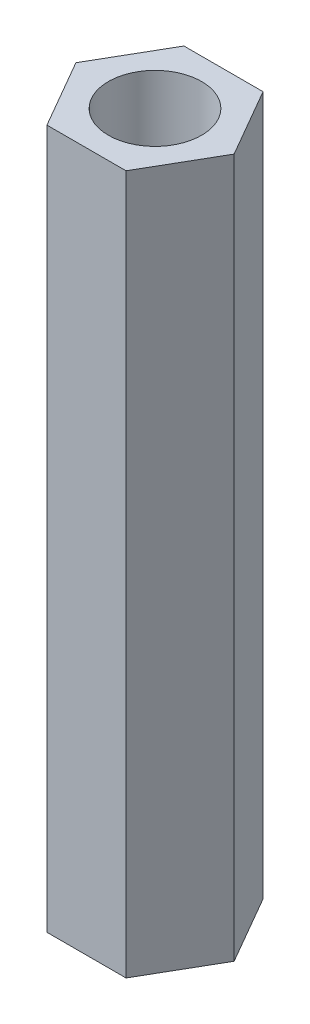
ISO-10303-21;
HEADER;
FILE_DESCRIPTION(('STEP AP214'),'2;1');
FILE_NAME('part.step','',(''),(''),'','','');
FILE_SCHEMA(('AUTOMOTIVE_DESIGN { 1 0 10303 214 1 1 1 1 }'));
ENDSEC;
DATA;
#1=APPLICATION_CONTEXT('core data for automotive mechanical design processes');
#2=APPLICATION_PROTOCOL_DEFINITION('international standard','automotive_design',2000,#1);
#3=PRODUCT_CONTEXT('',#1,'mechanical');
#4=PRODUCT('Part','Part','',(#3));
#5=PRODUCT_RELATED_PRODUCT_CATEGORY('part','',(#4));
#6=PRODUCT_DEFINITION_FORMATION('','',#4);
#7=PRODUCT_DEFINITION_CONTEXT('part definition',#1,'design');
#8=PRODUCT_DEFINITION('design','',#6,#7);
#9=PRODUCT_DEFINITION_SHAPE('','',#8);
#10=(LENGTH_UNIT() NAMED_UNIT(*) SI_UNIT(.MILLI.,.METRE.));
#11=(NAMED_UNIT(*) PLANE_ANGLE_UNIT() SI_UNIT($,.RADIAN.));
#12=(NAMED_UNIT(*) SI_UNIT($,.STERADIAN.) SOLID_ANGLE_UNIT());
#13=UNCERTAINTY_MEASURE_WITH_UNIT(LENGTH_MEASURE(1.E-05),#10,'distance_accuracy_value','');
#14=(GEOMETRIC_REPRESENTATION_CONTEXT(3) GLOBAL_UNCERTAINTY_ASSIGNED_CONTEXT((#13)) GLOBAL_UNIT_ASSIGNED_CONTEXT((#10,
#11,#12)) REPRESENTATION_CONTEXT('',''));
#15=CARTESIAN_POINT('',(0.,0.,0.));
#16=DIRECTION('',(0.,0.,1.));
#17=DIRECTION('',(1.,0.,0.));
#18=AXIS2_PLACEMENT_3D('',#15,#16,#17);
#19=CARTESIAN_POINT('',(0.,15.,0.));
#20=DIRECTION('',(0.,1.,0.));
#21=DIRECTION('',(0.,0.,1.));
#22=AXIS2_PLACEMENT_3D('',#19,#20,#21);
#23=PLANE('',#22);
#24=DIRECTION('',(-0.5,0.,-0.866025403784438));
#25=VECTOR('',#24,1.);
#26=CARTESIAN_POINT('',(1.69740979141749,15.,0.));
#27=LINE('',#26,#25);
#28=CARTESIAN_POINT('',(1.69740979141749,15.,0.));
#29=VERTEX_POINT('',#28);
#30=CARTESIAN_POINT('',(0.848704895708744,15.,-1.46999999999999));
#31=VERTEX_POINT('',#30);
#32=EDGE_CURVE('E135',#29,#31,#27,.T.);
#33=ORIENTED_EDGE('',*,*,#32,.T.);
#34=DIRECTION('',(-1.,0.,0.));
#35=VECTOR('',#34,1.);
#36=CARTESIAN_POINT('',(0.848704895708744,15.,-1.46999999999999));
#37=LINE('',#36,#35);
#38=CARTESIAN_POINT('',(-0.848704895708744,15.,-1.46999999999999));
#39=VERTEX_POINT('',#38);
#40=EDGE_CURVE('E93',#31,#39,#37,.T.);
#41=ORIENTED_EDGE('',*,*,#40,.T.);
#42=DIRECTION('',(-0.5,0.,0.866025403784439));
#43=VECTOR('',#42,1.);
#44=CARTESIAN_POINT('',(-0.848704895708744,15.,-1.46999999999999));
#45=LINE('',#44,#43);
#46=CARTESIAN_POINT('',(-1.69740979141749,15.,0.));
#47=VERTEX_POINT('',#46);
#48=EDGE_CURVE('E106',#39,#47,#45,.T.);
#49=ORIENTED_EDGE('',*,*,#48,.T.);
#50=DIRECTION('',(0.500000000000001,0.,0.866025403784438));
#51=VECTOR('',#50,1.);
#52=CARTESIAN_POINT('',(-1.69740979141749,15.,0.));
#53=LINE('',#52,#51);
#54=CARTESIAN_POINT('',(-0.848704895708743,15.,1.46999999999999));
#55=VERTEX_POINT('',#54);
#56=EDGE_CURVE('E100',#47,#55,#53,.T.);
#57=ORIENTED_EDGE('',*,*,#56,.T.);
#58=DIRECTION('',(1.,0.,0.));
#59=VECTOR('',#58,1.);
#60=CARTESIAN_POINT('',(-0.848704895708743,15.,1.46999999999999));
#61=LINE('',#60,#59);
#62=CARTESIAN_POINT('',(0.848704895708744,15.,1.46999999999999));
#63=VERTEX_POINT('',#62);
#64=EDGE_CURVE('E104',#55,#63,#61,.T.);
#65=ORIENTED_EDGE('',*,*,#64,.T.);
#66=DIRECTION('',(0.499999999999999,0.,-0.866025403784439));
#67=VECTOR('',#66,1.);
#68=CARTESIAN_POINT('',(0.848704895708744,15.,1.46999999999999));
#69=LINE('',#68,#67);
#70=EDGE_CURVE('E56',#63,#29,#69,.T.);
#71=ORIENTED_EDGE('',*,*,#70,.T.);
#72=EDGE_LOOP('',(#33,#41,#49,#57,#65,#71));
#73=FACE_BOUND('',#72,.T.);
#74=CARTESIAN_POINT('',(0.,15.,0.));
#75=DIRECTION('',(0.,1.,0.));
#76=DIRECTION('',(0.,0.,1.));
#77=AXIS2_PLACEMENT_3D('',#74,#75,#76);
#78=CIRCLE('',#77,1.);
#79=CARTESIAN_POINT('',(0.,15.,1.));
#80=VERTEX_POINT('',#79);
#81=EDGE_CURVE('E128',#80,#80,#78,.T.);
#82=ORIENTED_EDGE('',*,*,#81,.F.);
#83=EDGE_LOOP('',(#82));
#84=FACE_BOUND('',#83,.T.);
#85=ADVANCED_FACE('F39',(#73,#84),#23,.T.);
#86=CARTESIAN_POINT('',(0.,0.,0.));
#87=DIRECTION('',(0.,1.,0.));
#88=DIRECTION('',(0.,0.,1.));
#89=AXIS2_PLACEMENT_3D('',#86,#87,#88);
#90=PLANE('',#89);
#91=DIRECTION('',(-0.5,0.,-0.866025403784438));
#92=VECTOR('',#91,1.);
#93=CARTESIAN_POINT('',(1.69740979141749,0.,0.));
#94=LINE('',#93,#92);
#95=CARTESIAN_POINT('',(1.69740979141749,0.,0.));
#96=VERTEX_POINT('',#95);
#97=CARTESIAN_POINT('',(0.848704895708744,0.,-1.46999999999999));
#98=VERTEX_POINT('',#97);
#99=EDGE_CURVE('E124',#96,#98,#94,.T.);
#100=ORIENTED_EDGE('',*,*,#99,.F.);
#101=DIRECTION('',(0.499999999999999,0.,-0.866025403784439));
#102=VECTOR('',#101,1.);
#103=CARTESIAN_POINT('',(0.848704895708744,0.,1.46999999999999));
#104=LINE('',#103,#102);
#105=CARTESIAN_POINT('',(0.848704895708744,0.,1.46999999999999));
#106=VERTEX_POINT('',#105);
#107=EDGE_CURVE('E85',#106,#96,#104,.T.);
#108=ORIENTED_EDGE('',*,*,#107,.F.);
#109=DIRECTION('',(1.,0.,0.));
#110=VECTOR('',#109,1.);
#111=CARTESIAN_POINT('',(-0.848704895708743,0.,1.46999999999999));
#112=LINE('',#111,#110);
#113=CARTESIAN_POINT('',(-0.848704895708743,0.,1.46999999999999));
#114=VERTEX_POINT('',#113);
#115=EDGE_CURVE('E79',#114,#106,#112,.T.);
#116=ORIENTED_EDGE('',*,*,#115,.F.);
#117=DIRECTION('',(0.500000000000001,0.,0.866025403784438));
#118=VECTOR('',#117,1.);
#119=CARTESIAN_POINT('',(-1.69740979141749,0.,0.));
#120=LINE('',#119,#118);
#121=CARTESIAN_POINT('',(-1.69740979141749,0.,0.));
#122=VERTEX_POINT('',#121);
#123=EDGE_CURVE('E114',#122,#114,#120,.T.);
#124=ORIENTED_EDGE('',*,*,#123,.F.);
#125=DIRECTION('',(-0.5,0.,0.866025403784439));
#126=VECTOR('',#125,1.);
#127=CARTESIAN_POINT('',(-0.848704895708744,0.,-1.46999999999999));
#128=LINE('',#127,#126);
#129=CARTESIAN_POINT('',(-0.848704895708744,0.,-1.46999999999999));
#130=VERTEX_POINT('',#129);
#131=EDGE_CURVE('E130',#130,#122,#128,.T.);
#132=ORIENTED_EDGE('',*,*,#131,.F.);
#133=DIRECTION('',(-1.,0.,0.));
#134=VECTOR('',#133,1.);
#135=CARTESIAN_POINT('',(0.848704895708744,0.,-1.46999999999999));
#136=LINE('',#135,#134);
#137=EDGE_CURVE('E127',#98,#130,#136,.T.);
#138=ORIENTED_EDGE('',*,*,#137,.F.);
#139=EDGE_LOOP('',(#100,#108,#116,#124,#132,#138));
#140=FACE_BOUND('',#139,.T.);
#141=CARTESIAN_POINT('',(0.,0.,0.));
#142=DIRECTION('',(0.,1.,0.));
#143=DIRECTION('',(0.,0.,1.));
#144=AXIS2_PLACEMENT_3D('',#141,#142,#143);
#145=CIRCLE('',#144,1.);
#146=CARTESIAN_POINT('',(0.,0.,1.));
#147=VERTEX_POINT('',#146);
#148=EDGE_CURVE('E228',#147,#147,#145,.T.);
#149=ORIENTED_EDGE('',*,*,#148,.T.);
#150=EDGE_LOOP('',(#149));
#151=FACE_BOUND('',#150,.T.);
#152=ADVANCED_FACE('F144',(#140,#151),#90,.F.);
#153=CARTESIAN_POINT('',(1.69740979141749,15.,0.));
#154=DIRECTION('',(-0.866025403784438,0.,0.5));
#155=DIRECTION('',(0.5,0.,0.866025403784439));
#156=AXIS2_PLACEMENT_3D('',#153,#154,#155);
#157=PLANE('',#156);
#158=ORIENTED_EDGE('',*,*,#99,.T.);
#159=DIRECTION('',(0.,-1.,0.));
#160=VECTOR('',#159,1.);
#161=CARTESIAN_POINT('',(0.848704895708744,15.,-1.46999999999999));
#162=LINE('',#161,#160);
#163=EDGE_CURVE('E11',#31,#98,#162,.T.);
#164=ORIENTED_EDGE('',*,*,#163,.F.);
#165=ORIENTED_EDGE('',*,*,#32,.F.);
#166=DIRECTION('',(0.,-1.,0.));
#167=VECTOR('',#166,1.);
#168=CARTESIAN_POINT('',(1.69740979141749,15.,0.));
#169=LINE('',#168,#167);
#170=EDGE_CURVE('E120',#29,#96,#169,.T.);
#171=ORIENTED_EDGE('',*,*,#170,.T.);
#172=EDGE_LOOP('',(#158,#164,#165,#171));
#173=FACE_BOUND('',#172,.T.);
#174=ADVANCED_FACE('F41',(#173),#157,.F.);
#175=CARTESIAN_POINT('',(0.848704895708744,15.,-1.46999999999999));
#176=DIRECTION('',(0.,0.,1.));
#177=DIRECTION('',(1.,0.,0.));
#178=AXIS2_PLACEMENT_3D('',#175,#176,#177);
#179=PLANE('',#178);
#180=ORIENTED_EDGE('',*,*,#137,.T.);
#181=DIRECTION('',(0.,-1.,0.));
#182=VECTOR('',#181,1.);
#183=CARTESIAN_POINT('',(-0.848704895708744,15.,-1.46999999999999));
#184=LINE('',#183,#182);
#185=EDGE_CURVE('E48',#39,#130,#184,.T.);
#186=ORIENTED_EDGE('',*,*,#185,.F.);
#187=ORIENTED_EDGE('',*,*,#40,.F.);
#188=ORIENTED_EDGE('',*,*,#163,.T.);
#189=EDGE_LOOP('',(#180,#186,#187,#188));
#190=FACE_BOUND('',#189,.T.);
#191=ADVANCED_FACE('F169',(#190),#179,.F.);
#192=CARTESIAN_POINT('',(-0.848704895708744,15.,-1.46999999999999));
#193=DIRECTION('',(0.866025403784439,0.,0.5));
#194=DIRECTION('',(0.5,0.,-0.866025403784439));
#195=AXIS2_PLACEMENT_3D('',#192,#193,#194);
#196=PLANE('',#195);
#197=ORIENTED_EDGE('',*,*,#131,.T.);
#198=DIRECTION('',(0.,-1.,0.));
#199=VECTOR('',#198,1.);
#200=CARTESIAN_POINT('',(-1.69740979141749,15.,0.));
#201=LINE('',#200,#199);
#202=EDGE_CURVE('E115',#47,#122,#201,.T.);
#203=ORIENTED_EDGE('',*,*,#202,.F.);
#204=ORIENTED_EDGE('',*,*,#48,.F.);
#205=ORIENTED_EDGE('',*,*,#185,.T.);
#206=EDGE_LOOP('',(#197,#203,#204,#205));
#207=FACE_BOUND('',#206,.T.);
#208=ADVANCED_FACE('F141',(#207),#196,.F.);
#209=CARTESIAN_POINT('',(-1.69740979141749,15.,0.));
#210=DIRECTION('',(0.866025403784438,0.,-0.500000000000001));
#211=DIRECTION('',(-0.500000000000001,0.,-0.866025403784438));
#212=AXIS2_PLACEMENT_3D('',#209,#210,#211);
#213=PLANE('',#212);
#214=ORIENTED_EDGE('',*,*,#123,.T.);
#215=DIRECTION('',(0.,-1.,0.));
#216=VECTOR('',#215,1.);
#217=CARTESIAN_POINT('',(-0.848704895708743,15.,1.46999999999999));
#218=LINE('',#217,#216);
#219=EDGE_CURVE('E111',#55,#114,#218,.T.);
#220=ORIENTED_EDGE('',*,*,#219,.F.);
#221=ORIENTED_EDGE('',*,*,#56,.F.);
#222=ORIENTED_EDGE('',*,*,#202,.T.);
#223=EDGE_LOOP('',(#214,#220,#221,#222));
#224=FACE_BOUND('',#223,.T.);
#225=ADVANCED_FACE('F112',(#224),#213,.F.);
#226=CARTESIAN_POINT('',(-0.848704895708743,15.,1.46999999999999));
#227=DIRECTION('',(0.,0.,-1.));
#228=DIRECTION('',(-1.,0.,0.));
#229=AXIS2_PLACEMENT_3D('',#226,#227,#228);
#230=PLANE('',#229);
#231=ORIENTED_EDGE('',*,*,#115,.T.);
#232=DIRECTION('',(0.,-1.,0.));
#233=VECTOR('',#232,1.);
#234=CARTESIAN_POINT('',(0.848704895708744,15.,1.46999999999999));
#235=LINE('',#234,#233);
#236=EDGE_CURVE('E116',#63,#106,#235,.T.);
#237=ORIENTED_EDGE('',*,*,#236,.F.);
#238=ORIENTED_EDGE('',*,*,#64,.F.);
#239=ORIENTED_EDGE('',*,*,#219,.T.);
#240=EDGE_LOOP('',(#231,#237,#238,#239));
#241=FACE_BOUND('',#240,.T.);
#242=ADVANCED_FACE('F118',(#241),#230,.F.);
#243=CARTESIAN_POINT('',(0.848704895708744,15.,1.46999999999999));
#244=DIRECTION('',(-0.866025403784439,0.,-0.499999999999999));
#245=DIRECTION('',(-0.5,0.,0.866025403784439));
#246=AXIS2_PLACEMENT_3D('',#243,#244,#245);
#247=PLANE('',#246);
#248=ORIENTED_EDGE('',*,*,#107,.T.);
#249=ORIENTED_EDGE('',*,*,#170,.F.);
#250=ORIENTED_EDGE('',*,*,#70,.F.);
#251=ORIENTED_EDGE('',*,*,#236,.T.);
#252=EDGE_LOOP('',(#248,#249,#250,#251));
#253=FACE_BOUND('',#252,.T.);
#254=ADVANCED_FACE('F149',(#253),#247,.F.);
#255=CARTESIAN_POINT('',(0.,15.,0.));
#256=DIRECTION('',(0.,-1.,0.));
#257=DIRECTION('',(0.,0.,-1.));
#258=AXIS2_PLACEMENT_3D('',#255,#256,#257);
#259=CYLINDRICAL_SURFACE('',#258,1.);
#260=ORIENTED_EDGE('',*,*,#81,.T.);
#261=EDGE_LOOP('',(#260));
#262=FACE_BOUND('',#261,.T.);
#263=ORIENTED_EDGE('',*,*,#148,.F.);
#264=EDGE_LOOP('',(#263));
#265=FACE_BOUND('',#264,.T.);
#266=ADVANCED_FACE('F151',(#262,#265),#259,.F.);
#267=CLOSED_SHELL('',(#85,#152,#174,#191,#208,#225,#242,#254,#266));
#268=MANIFOLD_SOLID_BREP('B2',#267);
#269=ADVANCED_BREP_SHAPE_REPRESENTATION('',(#18,#268),#14);
#270=SHAPE_DEFINITION_REPRESENTATION(#9,#269);
ENDSEC;
END-ISO-10303-21;
